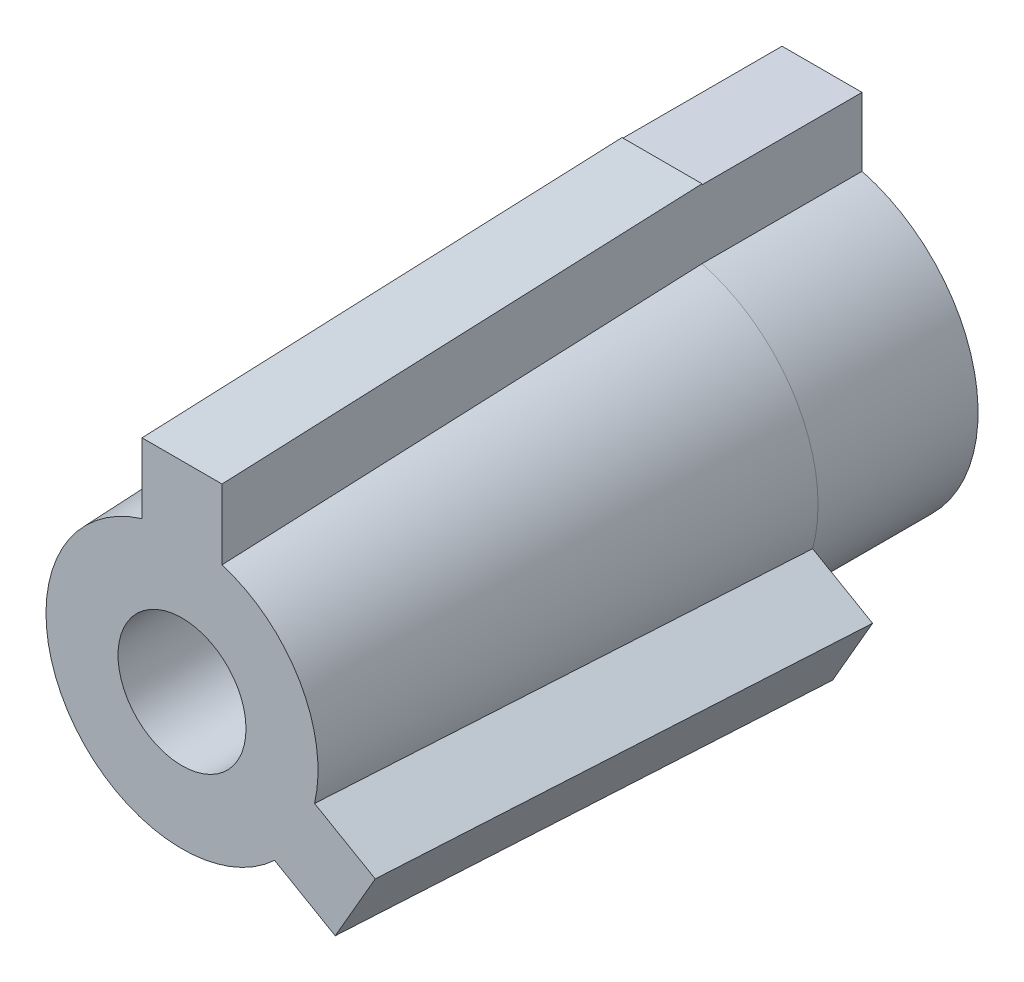
ISO-10303-21;
HEADER;
FILE_DESCRIPTION(('STEP AP214'),'2;1');
FILE_NAME('part.step','',(''),(''),'','','');
FILE_SCHEMA(('AUTOMOTIVE_DESIGN { 1 0 10303 214 1 1 1 1 }'));
ENDSEC;
DATA;
#1=APPLICATION_CONTEXT('core data for automotive mechanical design processes');
#2=APPLICATION_PROTOCOL_DEFINITION('international standard','automotive_design',2000,#1);
#3=PRODUCT_CONTEXT('',#1,'mechanical');
#4=PRODUCT('Part','Part','',(#3));
#5=PRODUCT_RELATED_PRODUCT_CATEGORY('part','',(#4));
#6=PRODUCT_DEFINITION_FORMATION('','',#4);
#7=PRODUCT_DEFINITION_CONTEXT('part definition',#1,'design');
#8=PRODUCT_DEFINITION('design','',#6,#7);
#9=PRODUCT_DEFINITION_SHAPE('','',#8);
#10=(LENGTH_UNIT() NAMED_UNIT(*) SI_UNIT(.MILLI.,.METRE.));
#11=(NAMED_UNIT(*) PLANE_ANGLE_UNIT() SI_UNIT($,.RADIAN.));
#12=(NAMED_UNIT(*) SI_UNIT($,.STERADIAN.) SOLID_ANGLE_UNIT());
#13=UNCERTAINTY_MEASURE_WITH_UNIT(LENGTH_MEASURE(1.E-05),#10,'distance_accuracy_value','');
#14=(GEOMETRIC_REPRESENTATION_CONTEXT(3) GLOBAL_UNCERTAINTY_ASSIGNED_CONTEXT((#13)) GLOBAL_UNIT_ASSIGNED_CONTEXT((#10,
#11,#12)) REPRESENTATION_CONTEXT('',''));
#15=CARTESIAN_POINT('',(0.,0.,0.));
#16=DIRECTION('',(0.,0.,1.));
#17=DIRECTION('',(1.,0.,0.));
#18=AXIS2_PLACEMENT_3D('',#15,#16,#17);
#19=CARTESIAN_POINT('',(0.,0.,30.));
#20=DIRECTION('',(0.,0.,-1.));
#21=DIRECTION('',(-1.,0.,0.));
#22=AXIS2_PLACEMENT_3D('',#19,#20,#21);
#23=CONICAL_SURFACE('',#22,8.5,0.0416425790985884);
#24=CARTESIAN_POINT('',(9.41146787119925,-2.54696216295817,-0.0003));
#25=CARTESIAN_POINT('',(9.29509275562805,-2.47977295865616,3.11691717846807));
#26=CARTESIAN_POINT('',(9.17855746173286,-2.41249127535568,6.23412639473847));
#27=CARTESIAN_POINT('',(8.94511358380526,-2.27771238959352,12.468526129827));
#28=CARTESIAN_POINT('',(8.82820499977992,-2.21021518713592,15.5857166486454));
#29=CARTESIAN_POINT('',(8.64033682723743,-2.10174944714635,20.5858053624622));
#30=CARTESIAN_POINT('',(8.56951259441104,-2.06085905725888,22.468710338264));
#31=CARTESIAN_POINT('',(8.42769385156102,-1.97897996789829,26.2345117610327));
#32=CARTESIAN_POINT('',(8.35669934153545,-1.93799126842404,28.1174082079994));
#33=CARTESIAN_POINT('',(8.28561231344632,-1.89694915362089,30.0003));
#34=B_SPLINE_CURVE_WITH_KNOTS('',3,(#24,#25,#26,#27,#28,#29,#30,#31,#32,#33),.UNSPECIFIED.,.F.,
.F.,(4,2,2,2,4),(0.,9.36033678212497,18.7206733869185,24.3747138081943,30.0287542941106),.UNSPECIFIED.);
#35=CARTESIAN_POINT('',(9.41145667145274,-2.54695569678151,0.));
#36=VERTEX_POINT('',#35);
#37=CARTESIAN_POINT('',(8.28562363973516,-1.89695569285681,30.));
#38=VERTEX_POINT('',#37);
#39=EDGE_CURVE('E80',#36,#38,#34,.T.);
#40=ORIENTED_EDGE('',*,*,#39,.F.);
#41=CARTESIAN_POINT('',(0.,0.,0.));
#42=DIRECTION('',(0.,0.,-1.));
#43=DIRECTION('',(-1.,0.,0.));
#44=AXIS2_PLACEMENT_3D('',#41,#42,#43);
#45=CIRCLE('',#44,9.75);
#46=CARTESIAN_POINT('',(2.5,9.42403841248539,0.));
#47=VERTEX_POINT('',#46);
#48=EDGE_CURVE('E400',#47,#36,#45,.T.);
#49=ORIENTED_EDGE('',*,*,#48,.F.);
#50=CARTESIAN_POINT('',(2.5,8.12402968565495,30.0002));
#51=CARTESIAN_POINT('',(2.5,8.24249781635268,27.2826893209817));
#52=CARTESIAN_POINT('',(2.5,8.36074520720026,24.5651690261928));
#53=CARTESIAN_POINT('',(2.5,8.59684563945044,19.130111347619));
#54=CARTESIAN_POINT('',(2.5,8.71469868085924,16.4125739638342));
#55=CARTESIAN_POINT('',(2.5,8.93121976652123,11.4125008529235));
#56=CARTESIAN_POINT('',(2.5,9.02993894337542,9.1299673394641));
#57=CARTESIAN_POINT('',(2.5,9.22715452444321,4.56489065804626));
#58=CARTESIAN_POINT('',(2.5,9.32565092865386,2.28234749008774));
#59=CARTESIAN_POINT('',(2.5,9.4240470340544,-0.000199999999999783));
#60=B_SPLINE_CURVE_WITH_KNOTS('',3,(#50,#51,#52,#53,#54,#55,#56,#57,#58,#59),.UNSPECIFIED.,.F.,
.F.,(4,2,2,2,4),(0.,8.16027515367008,16.3205501790712,23.1745520976338,30.0285541065657),.UNSPECIFIED.);
#61=CARTESIAN_POINT('',(2.5,8.12403840463596,30.));
#62=VERTEX_POINT('',#61);
#63=EDGE_CURVE('E393',#62,#47,#60,.T.);
#64=ORIENTED_EDGE('',*,*,#63,.F.);
#65=CARTESIAN_POINT('',(0.,0.,30.));
#66=DIRECTION('',(0.,0.,1.));
#67=DIRECTION('',(1.,0.,0.));
#68=AXIS2_PLACEMENT_3D('',#65,#66,#67);
#69=CIRCLE('',#68,8.5);
#70=EDGE_CURVE('E344',#38,#62,#69,.T.);
#71=ORIENTED_EDGE('',*,*,#70,.F.);
#72=EDGE_LOOP('',(#40,#49,#64,#71));
#73=FACE_BOUND('',#72,.T.);
#74=ADVANCED_FACE('F53',(#73),#23,.T.);
#75=CARTESIAN_POINT('',(0.,0.,-10.));
#76=DIRECTION('',(0.,0.,-1.));
#77=DIRECTION('',(-1.,0.,0.));
#78=AXIS2_PLACEMENT_3D('',#75,#76,#77);
#79=PLANE('',#78);
#80=CARTESIAN_POINT('',(0.,0.,-10.));
#81=DIRECTION('',(0.,0.,-1.));
#82=DIRECTION('',(-1.,0.,0.));
#83=AXIS2_PLACEMENT_3D('',#80,#81,#82);
#84=CIRCLE('',#83,9.75);
#85=CARTESIAN_POINT('',(2.5,9.42403841248538,-10.));
#86=VERTEX_POINT('',#85);
#87=CARTESIAN_POINT('',(-2.5,9.42403841248538,-10.));
#88=VERTEX_POINT('',#87);
#89=EDGE_CURVE('E12',#86,#88,#84,.T.);
#90=ORIENTED_EDGE('',*,*,#89,.T.);
#91=DIRECTION('',(0.,1.,0.));
#92=VECTOR('',#91,1.);
#93=CARTESIAN_POINT('',(-2.5,13.6944775572609,-10.));
#94=LINE('',#93,#92);
#95=CARTESIAN_POINT('',(-2.5,13.6944775572609,-10.));
#96=VERTEX_POINT('',#95);
#97=EDGE_CURVE('E506',#88,#96,#94,.T.);
#98=ORIENTED_EDGE('',*,*,#97,.T.);
#99=DIRECTION('',(1.,0.,0.));
#100=VECTOR('',#99,1.);
#101=CARTESIAN_POINT('',(2.5,13.6944775572609,-10.));
#102=LINE('',#101,#100);
#103=CARTESIAN_POINT('',(2.5,13.6944775572609,-10.));
#104=VERTEX_POINT('',#103);
#105=EDGE_CURVE('E143',#96,#104,#102,.T.);
#106=ORIENTED_EDGE('',*,*,#105,.T.);
#107=DIRECTION('',(0.,-1.,0.));
#108=VECTOR('',#107,1.);
#109=CARTESIAN_POINT('',(2.5,13.6944775572609,-10.));
#110=LINE('',#109,#108);
#111=EDGE_CURVE('E508',#104,#86,#110,.T.);
#112=ORIENTED_EDGE('',*,*,#111,.T.);
#113=EDGE_LOOP('',(#90,#98,#106,#112));
#114=FACE_BOUND('',#113,.T.);
#115=CARTESIAN_POINT('',(0.,0.,-10.));
#116=DIRECTION('',(0.,0.,1.));
#117=DIRECTION('',(1.,0.,0.));
#118=AXIS2_PLACEMENT_3D('',#115,#116,#117);
#119=CIRCLE('',#118,4.);
#120=CARTESIAN_POINT('',(4.,0.,-10.));
#121=VERTEX_POINT('',#120);
#122=EDGE_CURVE('E206',#121,#121,#119,.T.);
#123=ORIENTED_EDGE('',*,*,#122,.T.);
#124=EDGE_LOOP('',(#123));
#125=FACE_BOUND('',#124,.T.);
#126=ADVANCED_FACE('F216',(#114,#125),#79,.T.);
#127=CARTESIAN_POINT('',(0.,0.,-10.));
#128=DIRECTION('',(0.,0.,1.));
#129=DIRECTION('',(1.,0.,0.));
#130=AXIS2_PLACEMENT_3D('',#127,#128,#129);
#131=CYLINDRICAL_SURFACE('',#130,9.75);
#132=ORIENTED_EDGE('',*,*,#89,.F.);
#133=DIRECTION('',(0.,0.,1.));
#134=VECTOR('',#133,1.);
#135=CARTESIAN_POINT('',(2.5,9.42403841248538,-10.));
#136=LINE('',#135,#134);
#137=EDGE_CURVE('E301',#86,#47,#136,.T.);
#138=ORIENTED_EDGE('',*,*,#137,.T.);
#139=ORIENTED_EDGE('',*,*,#48,.T.);
#140=CARTESIAN_POINT('',(6.91145667145278,-6.87708271570372,0.));
#141=VERTEX_POINT('',#140);
#142=EDGE_CURVE('E299',#36,#141,#45,.T.);
#143=ORIENTED_EDGE('',*,*,#142,.T.);
#144=CARTESIAN_POINT('',(-2.5,9.42403841248538,0.));
#145=VERTEX_POINT('',#144);
#146=EDGE_CURVE('E327',#141,#145,#45,.T.);
#147=ORIENTED_EDGE('',*,*,#146,.T.);
#148=DIRECTION('',(0.,0.,1.));
#149=VECTOR('',#148,1.);
#150=CARTESIAN_POINT('',(-2.5,9.42403841248538,-10.));
#151=LINE('',#150,#149);
#152=EDGE_CURVE('E304',#145,#88,#151,.F.);
#153=ORIENTED_EDGE('',*,*,#152,.T.);
#154=EDGE_LOOP('',(#132,#138,#139,#143,#147,#153));
#155=FACE_BOUND('',#154,.T.);
#156=ADVANCED_FACE('F213',(#155),#131,.T.);
#157=CARTESIAN_POINT('',(5.78561231344636,-6.22707617254311,30.0003));
#158=CARTESIAN_POINT('',(5.88820867863115,-6.28631021160043,27.2827906533351));
#159=CARTESIAN_POINT('',(5.99061387737499,-6.3454338806616,24.5652716908931));
#160=CARTESIAN_POINT('',(6.19508275801426,-6.46348404393958,19.1302166770018));
#161=CARTESIAN_POINT('',(6.29714643991506,-6.52241053815949,16.4126806255529));
#162=CARTESIAN_POINT('',(6.48466045797715,-6.63067180696446,11.4125741816074));
#163=CARTESIAN_POINT('',(6.57015507297004,-6.68003214594487,9.13000600261256));
#164=CARTESIAN_POINT('',(6.74095137031244,-6.7786414341921,4.56485998982951));
#165=CARTESIAN_POINT('',(6.82625305265941,-6.82789038345745,2.28228215604118));
#166=CARTESIAN_POINT('',(6.91146787119929,-6.87708918188039,-0.000300000000001189));
#167=B_SPLINE_CURVE_WITH_KNOTS('',3,(#157,#158,#159,#160,#161,#162,#163,#164,#165,#166),
.UNSPECIFIED.,.F.,.F.,(4,2,2,2,4),(0.,8.16027115353201,16.3205421787942,23.1746481914194,
30.0287542944173),.UNSPECIFIED.);
#168=CARTESIAN_POINT('',(5.7856236397352,-6.22708271177902,30.));
#169=VERTEX_POINT('',#168);
#170=EDGE_CURVE('E234',#169,#141,#167,.T.);
#171=ORIENTED_EDGE('',*,*,#170,.F.);
#172=CARTESIAN_POINT('',(-2.5,8.12403840463596,30.));
#173=VERTEX_POINT('',#172);
#174=EDGE_CURVE('E64',#173,#169,#69,.T.);
#175=ORIENTED_EDGE('',*,*,#174,.F.);
#176=CARTESIAN_POINT('',(-2.5,9.4240470340544,-0.000199999999999952));
#177=CARTESIAN_POINT('',(-2.5,9.28966867883866,3.11701584615142));
#178=CARTESIAN_POINT('',(-2.5,9.15510536553462,6.23422373010108));
#179=CARTESIAN_POINT('',(-2.5,8.88554770037746,12.4686208005381));
#180=CARTESIAN_POINT('',(-2.5,8.75055334853249,15.5858099870258));
#181=CARTESIAN_POINT('',(-2.5,8.5336233069397,20.5858653672199));
#182=CARTESIAN_POINT('',(-2.5,8.45184391554205,22.4687383418629));
#183=CARTESIAN_POINT('',(-2.5,8.28808852027685,26.2344757626045));
#184=CARTESIAN_POINT('',(-2.5,8.20611251640704,28.117340208703));
#185=CARTESIAN_POINT('',(-2.5,8.12402968565495,30.0002));
#186=B_SPLINE_CURVE_WITH_KNOTS('',3,(#176,#177,#178,#179,#180,#181,#182,#183,#184,#185),
.UNSPECIFIED.,.F.,.F.,(4,2,2,2,4),(0.,9.36033278198581,18.7206653866414,24.3746097141312,
30.0285541062589),.UNSPECIFIED.);
#187=EDGE_CURVE('E204',#145,#173,#186,.T.);
#188=ORIENTED_EDGE('',*,*,#187,.F.);
#189=ORIENTED_EDGE('',*,*,#146,.F.);
#190=EDGE_LOOP('',(#171,#175,#188,#189));
#191=FACE_BOUND('',#190,.T.);
#192=ADVANCED_FACE('F208',(#191),#23,.T.);
#193=CARTESIAN_POINT('',(0.,0.,30.));
#194=DIRECTION('',(0.,0.,1.));
#195=DIRECTION('',(1.,0.,0.));
#196=AXIS2_PLACEMENT_3D('',#193,#194,#195);
#197=PLANE('',#196);
#198=ORIENTED_EDGE('',*,*,#174,.T.);
#199=DIRECTION('',(0.866025403784443,-0.499999999999992,0.));
#200=VECTOR('',#199,1.);
#201=CARTESIAN_POINT('',(9.57531754730556,-8.41506350946101,30.));
#202=LINE('',#201,#200);
#203=CARTESIAN_POINT('',(9.57531754730556,-8.41506350946101,30.));
#204=VERTEX_POINT('',#203);
#205=EDGE_CURVE('E330',#169,#204,#202,.T.);
#206=ORIENTED_EDGE('',*,*,#205,.T.);
#207=DIRECTION('',(0.499999999999992,0.866025403784443,0.));
#208=VECTOR('',#207,1.);
#209=CARTESIAN_POINT('',(12.0753175473055,-4.08493649053879,30.));
#210=LINE('',#209,#208);
#211=CARTESIAN_POINT('',(12.0753175473055,-4.08493649053879,30.));
#212=VERTEX_POINT('',#211);
#213=EDGE_CURVE('E332',#204,#212,#210,.T.);
#214=ORIENTED_EDGE('',*,*,#213,.T.);
#215=DIRECTION('',(-0.866025403784443,0.499999999999992,0.));
#216=VECTOR('',#215,1.);
#217=CARTESIAN_POINT('',(12.0753175473055,-4.08493649053879,30.));
#218=LINE('',#217,#216);
#219=EDGE_CURVE('E309',#212,#38,#218,.T.);
#220=ORIENTED_EDGE('',*,*,#219,.T.);
#221=ORIENTED_EDGE('',*,*,#70,.T.);
#222=DIRECTION('',(0.,1.,0.));
#223=VECTOR('',#222,1.);
#224=CARTESIAN_POINT('',(2.5,12.5,30.));
#225=LINE('',#224,#223);
#226=CARTESIAN_POINT('',(2.5,12.5,30.));
#227=VERTEX_POINT('',#226);
#228=EDGE_CURVE('E409',#62,#227,#225,.T.);
#229=ORIENTED_EDGE('',*,*,#228,.T.);
#230=DIRECTION('',(-1.,0.,0.));
#231=VECTOR('',#230,1.);
#232=CARTESIAN_POINT('',(-2.5,12.5,30.));
#233=LINE('',#232,#231);
#234=CARTESIAN_POINT('',(-2.5,12.5,30.));
#235=VERTEX_POINT('',#234);
#236=EDGE_CURVE('E411',#227,#235,#233,.T.);
#237=ORIENTED_EDGE('',*,*,#236,.T.);
#238=DIRECTION('',(0.,-1.,0.));
#239=VECTOR('',#238,1.);
#240=CARTESIAN_POINT('',(-2.5,12.5,30.));
#241=LINE('',#240,#239);
#242=EDGE_CURVE('E412',#235,#173,#241,.T.);
#243=ORIENTED_EDGE('',*,*,#242,.T.);
#244=EDGE_LOOP('',(#198,#206,#214,#220,#221,#229,#237,#243));
#245=FACE_BOUND('',#244,.T.);
#246=CARTESIAN_POINT('',(0.,0.,30.));
#247=DIRECTION('',(0.,0.,1.));
#248=DIRECTION('',(1.,0.,0.));
#249=AXIS2_PLACEMENT_3D('',#246,#247,#248);
#250=CIRCLE('',#249,4.);
#251=CARTESIAN_POINT('',(4.,0.,30.));
#252=VERTEX_POINT('',#251);
#253=EDGE_CURVE('E387',#252,#252,#250,.T.);
#254=ORIENTED_EDGE('',*,*,#253,.F.);
#255=EDGE_LOOP('',(#254));
#256=FACE_BOUND('',#255,.T.);
#257=ADVANCED_FACE('F55',(#245,#256),#197,.T.);
#258=CARTESIAN_POINT('',(0.,0.,-10.));
#259=DIRECTION('',(0.,0.,1.));
#260=DIRECTION('',(1.,0.,0.));
#261=AXIS2_PLACEMENT_3D('',#258,#259,#260);
#262=CYLINDRICAL_SURFACE('',#261,4.);
#263=ORIENTED_EDGE('',*,*,#122,.F.);
#264=EDGE_LOOP('',(#263));
#265=FACE_BOUND('',#264,.T.);
#266=ORIENTED_EDGE('',*,*,#253,.T.);
#267=EDGE_LOOP('',(#266));
#268=FACE_BOUND('',#267,.T.);
#269=ADVANCED_FACE('F215',(#265,#268),#262,.F.);
#270=CARTESIAN_POINT('',(0.,0.,0.));
#271=DIRECTION('',(0.,0.,1.));
#272=DIRECTION('',(1.,0.,0.));
#273=AXIS2_PLACEMENT_3D('',#270,#271,#272);
#274=PLANE('',#273);
#275=DIRECTION('',(0.,1.,0.));
#276=VECTOR('',#275,1.);
#277=CARTESIAN_POINT('',(2.5,13.75,0.));
#278=LINE('',#277,#276);
#279=CARTESIAN_POINT('',(2.5,13.6944775572609,0.));
#280=VERTEX_POINT('',#279);
#281=CARTESIAN_POINT('',(2.5,13.75,0.));
#282=VERTEX_POINT('',#281);
#283=EDGE_CURVE('E154',#280,#282,#278,.T.);
#284=ORIENTED_EDGE('',*,*,#283,.F.);
#285=DIRECTION('',(1.,0.,0.));
#286=VECTOR('',#285,1.);
#287=CARTESIAN_POINT('',(2.5,13.6944775572609,0.));
#288=LINE('',#287,#286);
#289=CARTESIAN_POINT('',(-2.5,13.6944775572609,0.));
#290=VERTEX_POINT('',#289);
#291=EDGE_CURVE('E72',#290,#280,#288,.T.);
#292=ORIENTED_EDGE('',*,*,#291,.F.);
#293=DIRECTION('',(0.,-1.,0.));
#294=VECTOR('',#293,1.);
#295=CARTESIAN_POINT('',(-2.5,13.75,0.));
#296=LINE('',#295,#294);
#297=CARTESIAN_POINT('',(-2.5,13.75,0.));
#298=VERTEX_POINT('',#297);
#299=EDGE_CURVE('E58',#298,#290,#296,.T.);
#300=ORIENTED_EDGE('',*,*,#299,.F.);
#301=DIRECTION('',(-1.,0.,0.));
#302=VECTOR('',#301,1.);
#303=CARTESIAN_POINT('',(-2.5,13.75,0.));
#304=LINE('',#303,#302);
#305=EDGE_CURVE('E423',#282,#298,#304,.T.);
#306=ORIENTED_EDGE('',*,*,#305,.F.);
#307=EDGE_LOOP('',(#284,#292,#300,#306));
#308=FACE_BOUND('',#307,.T.);
#309=ADVANCED_FACE('F151',(#308),#274,.F.);
#310=CARTESIAN_POINT('',(0.,13.7261698440208,0.571923743500866));
#311=DIRECTION('',(0.,0.999133073092352,0.0416305447121813));
#312=DIRECTION('',(0.,-0.0416305447121813,0.999133073092352));
#313=AXIS2_PLACEMENT_3D('',#310,#311,#312);
#314=PLANE('',#313);
#315=DIRECTION('',(0.,0.0416305447121813,-0.999133073092352));
#316=VECTOR('',#315,1.);
#317=CARTESIAN_POINT('',(2.5,12.5,30.));
#318=LINE('',#317,#316);
#319=EDGE_CURVE('E426',#227,#282,#318,.T.);
#320=ORIENTED_EDGE('',*,*,#319,.T.);
#321=ORIENTED_EDGE('',*,*,#305,.T.);
#322=DIRECTION('',(0.,0.0416305447121813,-0.999133073092352));
#323=VECTOR('',#322,1.);
#324=CARTESIAN_POINT('',(-2.5,12.5,30.));
#325=LINE('',#324,#323);
#326=EDGE_CURVE('E161',#235,#298,#325,.T.);
#327=ORIENTED_EDGE('',*,*,#326,.F.);
#328=ORIENTED_EDGE('',*,*,#236,.F.);
#329=EDGE_LOOP('',(#320,#321,#327,#328));
#330=FACE_BOUND('',#329,.T.);
#331=ADVANCED_FACE('F184',(#330),#314,.T.);
#332=CARTESIAN_POINT('',(-2.5,0.,0.));
#333=DIRECTION('',(-1.,0.,0.));
#334=DIRECTION('',(0.,0.,1.));
#335=AXIS2_PLACEMENT_3D('',#332,#333,#334);
#336=PLANE('',#335);
#337=ORIENTED_EDGE('',*,*,#299,.T.);
#338=DIRECTION('',(0.,0.,-1.));
#339=VECTOR('',#338,1.);
#340=CARTESIAN_POINT('',(-2.5,13.6944775572609,0.));
#341=LINE('',#340,#339);
#342=EDGE_CURVE('E140',#290,#96,#341,.T.);
#343=ORIENTED_EDGE('',*,*,#342,.T.);
#344=ORIENTED_EDGE('',*,*,#97,.F.);
#345=ORIENTED_EDGE('',*,*,#152,.F.);
#346=ORIENTED_EDGE('',*,*,#187,.T.);
#347=ORIENTED_EDGE('',*,*,#242,.F.);
#348=ORIENTED_EDGE('',*,*,#326,.T.);
#349=EDGE_LOOP('',(#337,#343,#344,#345,#346,#347,#348));
#350=FACE_BOUND('',#349,.T.);
#351=ADVANCED_FACE('F158',(#350),#336,.T.);
#352=CARTESIAN_POINT('',(2.5,0.,0.));
#353=DIRECTION('',(1.,0.,0.));
#354=DIRECTION('',(0.,1.,0.));
#355=AXIS2_PLACEMENT_3D('',#352,#353,#354);
#356=PLANE('',#355);
#357=ORIENTED_EDGE('',*,*,#228,.F.);
#358=ORIENTED_EDGE('',*,*,#63,.T.);
#359=ORIENTED_EDGE('',*,*,#137,.F.);
#360=ORIENTED_EDGE('',*,*,#111,.F.);
#361=DIRECTION('',(0.,0.,-1.));
#362=VECTOR('',#361,1.);
#363=CARTESIAN_POINT('',(2.5,13.6944775572609,0.));
#364=LINE('',#363,#362);
#365=EDGE_CURVE('E146',#280,#104,#364,.T.);
#366=ORIENTED_EDGE('',*,*,#365,.F.);
#367=ORIENTED_EDGE('',*,*,#283,.T.);
#368=ORIENTED_EDGE('',*,*,#319,.F.);
#369=EDGE_LOOP('',(#357,#358,#359,#360,#366,#367,#368));
#370=FACE_BOUND('',#369,.T.);
#371=ADVANCED_FACE('F183',(#370),#356,.T.);
#372=CARTESIAN_POINT('',(0.,0.,0.));
#373=DIRECTION('',(0.,0.,1.));
#374=DIRECTION('',(-0.499999999999992,-0.866025403784443,0.));
#375=AXIS2_PLACEMENT_3D('',#372,#373,#374);
#376=PLANE('',#375);
#377=ORIENTED_EDGE('',*,*,#142,.F.);
#378=DIRECTION('',(-0.866025403784443,0.499999999999992,0.));
#379=VECTOR('',#378,1.);
#380=CARTESIAN_POINT('',(13.1578493020361,-4.70993649053878,0.));
#381=LINE('',#380,#379);
#382=CARTESIAN_POINT('',(13.1578493020361,-4.70993649053878,0.));
#383=VERTEX_POINT('',#382);
#384=EDGE_CURVE('E295',#383,#36,#381,.T.);
#385=ORIENTED_EDGE('',*,*,#384,.F.);
#386=DIRECTION('',(0.499999999999992,0.866025403784443,0.));
#387=VECTOR('',#386,1.);
#388=CARTESIAN_POINT('',(13.1578493020361,-4.70993649053878,0.));
#389=LINE('',#388,#387);
#390=CARTESIAN_POINT('',(10.6578493020361,-9.040063509461,0.));
#391=VERTEX_POINT('',#390);
#392=EDGE_CURVE('E286',#391,#383,#389,.T.);
#393=ORIENTED_EDGE('',*,*,#392,.F.);
#394=DIRECTION('',(0.866025403784443,-0.499999999999992,0.));
#395=VECTOR('',#394,1.);
#396=CARTESIAN_POINT('',(10.6578493020361,-9.040063509461,0.));
#397=LINE('',#396,#395);
#398=EDGE_CURVE('E274',#141,#391,#397,.T.);
#399=ORIENTED_EDGE('',*,*,#398,.F.);
#400=EDGE_LOOP('',(#377,#385,#393,#399));
#401=FACE_BOUND('',#400,.T.);
#402=ADVANCED_FACE('F244',(#401),#376,.F.);
#403=CARTESIAN_POINT('',(11.887211781582,-6.86308492201029,0.571923743500866));
#404=DIRECTION('',(0.865274623059196,-0.499566536546168,0.0416305447121813));
#405=DIRECTION('',(-0.0360531092941331,0.0208152723560903,0.999133073092352));
#406=AXIS2_PLACEMENT_3D('',#403,#404,#405);
#407=PLANE('',#406);
#408=DIRECTION('',(0.0360531092941331,-0.0208152723560904,-0.999133073092352));
#409=VECTOR('',#408,1.);
#410=CARTESIAN_POINT('',(9.57531754730556,-8.41506350946101,30.));
#411=LINE('',#410,#409);
#412=EDGE_CURVE('E347',#204,#391,#411,.T.);
#413=ORIENTED_EDGE('',*,*,#412,.T.);
#414=ORIENTED_EDGE('',*,*,#392,.T.);
#415=DIRECTION('',(0.0360531092941331,-0.0208152723560903,-0.999133073092352));
#416=VECTOR('',#415,1.);
#417=CARTESIAN_POINT('',(12.0753175473055,-4.08493649053879,30.));
#418=LINE('',#417,#416);
#419=EDGE_CURVE('E346',#212,#383,#418,.T.);
#420=ORIENTED_EDGE('',*,*,#419,.F.);
#421=ORIENTED_EDGE('',*,*,#213,.F.);
#422=EDGE_LOOP('',(#413,#414,#420,#421));
#423=FACE_BOUND('',#422,.T.);
#424=ADVANCED_FACE('F358',(#423),#407,.T.);
#425=CARTESIAN_POINT('',(1.24999999999998,2.16506350946111,0.));
#426=DIRECTION('',(0.499999999999992,0.866025403784443,0.));
#427=DIRECTION('',(0.,0.,1.));
#428=AXIS2_PLACEMENT_3D('',#425,#426,#427);
#429=PLANE('',#428);
#430=ORIENTED_EDGE('',*,*,#384,.T.);
#431=ORIENTED_EDGE('',*,*,#39,.T.);
#432=ORIENTED_EDGE('',*,*,#219,.F.);
#433=ORIENTED_EDGE('',*,*,#419,.T.);
#434=EDGE_LOOP('',(#430,#431,#432,#433));
#435=FACE_BOUND('',#434,.T.);
#436=ADVANCED_FACE('F240',(#435),#429,.T.);
#437=CARTESIAN_POINT('',(-1.24999999999998,-2.16506350946111,0.));
#438=DIRECTION('',(-0.499999999999992,-0.866025403784443,0.));
#439=DIRECTION('',(0.866025403784443,-0.499999999999992,0.));
#440=AXIS2_PLACEMENT_3D('',#437,#438,#439);
#441=PLANE('',#440);
#442=ORIENTED_EDGE('',*,*,#205,.F.);
#443=ORIENTED_EDGE('',*,*,#170,.T.);
#444=ORIENTED_EDGE('',*,*,#398,.T.);
#445=ORIENTED_EDGE('',*,*,#412,.F.);
#446=EDGE_LOOP('',(#442,#443,#444,#445));
#447=FACE_BOUND('',#446,.T.);
#448=ADVANCED_FACE('F236',(#447),#441,.T.);
#449=CARTESIAN_POINT('',(2.5,13.6944775572609,0.));
#450=DIRECTION('',(0.,1.,0.));
#451=DIRECTION('',(0.,0.,1.));
#452=AXIS2_PLACEMENT_3D('',#449,#450,#451);
#453=PLANE('',#452);
#454=ORIENTED_EDGE('',*,*,#105,.F.);
#455=ORIENTED_EDGE('',*,*,#342,.F.);
#456=ORIENTED_EDGE('',*,*,#291,.T.);
#457=ORIENTED_EDGE('',*,*,#365,.T.);
#458=EDGE_LOOP('',(#454,#455,#456,#457));
#459=FACE_BOUND('',#458,.T.);
#460=ADVANCED_FACE('F141',(#459),#453,.T.);
#461=CLOSED_SHELL('',(#74,#126,#156,#192,#257,#269,#309,#331,#351,#371,#402,#424,#436,#448,#460));
#462=MANIFOLD_SOLID_BREP('B2',#461);
#463=ADVANCED_BREP_SHAPE_REPRESENTATION('',(#18,#462),#14);
#464=SHAPE_DEFINITION_REPRESENTATION(#9,#463);
ENDSEC;
END-ISO-10303-21;
